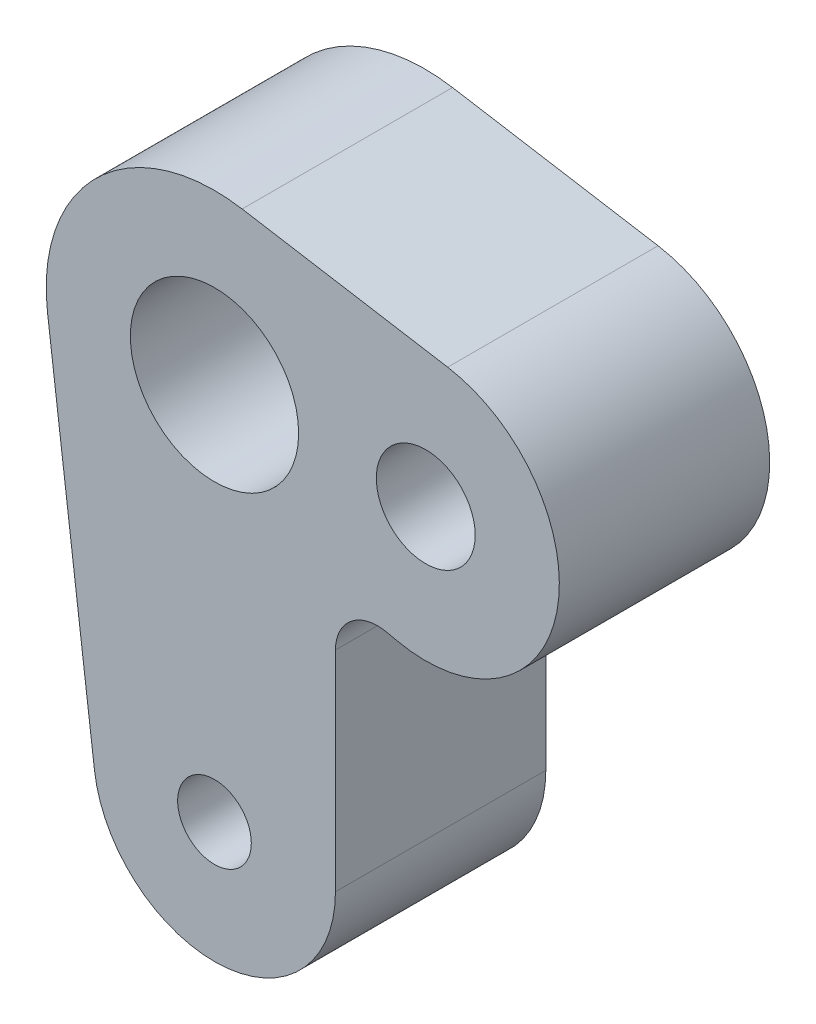
ISO-10303-21;
HEADER;
FILE_DESCRIPTION(('STEP AP214'),'2;1');
FILE_NAME('part.step','',(''),(''),'','','');
FILE_SCHEMA(('AUTOMOTIVE_DESIGN { 1 0 10303 214 1 1 1 1 }'));
ENDSEC;
DATA;
#1=APPLICATION_CONTEXT('core data for automotive mechanical design processes');
#2=APPLICATION_PROTOCOL_DEFINITION('international standard','automotive_design',2000,#1);
#3=PRODUCT_CONTEXT('',#1,'mechanical');
#4=PRODUCT('Part','Part','',(#3));
#5=PRODUCT_RELATED_PRODUCT_CATEGORY('part','',(#4));
#6=PRODUCT_DEFINITION_FORMATION('','',#4);
#7=PRODUCT_DEFINITION_CONTEXT('part definition',#1,'design');
#8=PRODUCT_DEFINITION('design','',#6,#7);
#9=PRODUCT_DEFINITION_SHAPE('','',#8);
#10=(LENGTH_UNIT() NAMED_UNIT(*) SI_UNIT(.MILLI.,.METRE.));
#11=(NAMED_UNIT(*) PLANE_ANGLE_UNIT() SI_UNIT($,.RADIAN.));
#12=(NAMED_UNIT(*) SI_UNIT($,.STERADIAN.) SOLID_ANGLE_UNIT());
#13=UNCERTAINTY_MEASURE_WITH_UNIT(LENGTH_MEASURE(1.E-05),#10,'distance_accuracy_value','');
#14=(GEOMETRIC_REPRESENTATION_CONTEXT(3) GLOBAL_UNCERTAINTY_ASSIGNED_CONTEXT((#13)) GLOBAL_UNIT_ASSIGNED_CONTEXT((#10,
#11,#12)) REPRESENTATION_CONTEXT('',''));
#15=CARTESIAN_POINT('',(0.,0.,0.));
#16=DIRECTION('',(0.,0.,1.));
#17=DIRECTION('',(1.,0.,0.));
#18=AXIS2_PLACEMENT_3D('',#15,#16,#17);
#19=CARTESIAN_POINT('',(10.0423494024106,0.,10.));
#20=DIRECTION('',(0.,0.,-1.));
#21=DIRECTION('',(-1.,0.,0.));
#22=AXIS2_PLACEMENT_3D('',#19,#20,#21);
#23=CYLINDRICAL_SURFACE('',#22,6.35);
#24=CARTESIAN_POINT('',(10.0423494024106,0.,0.));
#25=DIRECTION('',(0.,0.,1.));
#26=DIRECTION('',(1.,0.,0.));
#27=AXIS2_PLACEMENT_3D('',#24,#25,#26);
#28=CIRCLE('',#27,6.35);
#29=CARTESIAN_POINT('',(8.68728342325971,-6.20373244040617,0.));
#30=VERTEX_POINT('',#29);
#31=CARTESIAN_POINT('',(11.0856809556311,6.26370172262812,0.));
#32=VERTEX_POINT('',#31);
#33=EDGE_CURVE('E161',#30,#32,#28,.T.);
#34=ORIENTED_EDGE('',*,*,#33,.T.);
#35=DIRECTION('',(0.,0.,-1.));
#36=VECTOR('',#35,1.);
#37=CARTESIAN_POINT('',(11.0856809556311,6.26370172262812,10.));
#38=LINE('',#37,#36);
#39=CARTESIAN_POINT('',(11.0856809556311,6.26370172262812,10.));
#40=VERTEX_POINT('',#39);
#41=EDGE_CURVE('E11',#40,#32,#38,.T.);
#42=ORIENTED_EDGE('',*,*,#41,.F.);
#43=CARTESIAN_POINT('',(10.0423494024106,0.,10.));
#44=DIRECTION('',(0.,0.,1.));
#45=DIRECTION('',(1.,0.,0.));
#46=AXIS2_PLACEMENT_3D('',#43,#44,#45);
#47=CIRCLE('',#46,6.35);
#48=CARTESIAN_POINT('',(8.68728342325971,-6.20373244040617,10.));
#49=VERTEX_POINT('',#48);
#50=EDGE_CURVE('E195',#49,#40,#47,.T.);
#51=ORIENTED_EDGE('',*,*,#50,.F.);
#52=DIRECTION('',(0.,0.,-1.));
#53=VECTOR('',#52,1.);
#54=CARTESIAN_POINT('',(8.68728342325971,-6.20373244040617,10.));
#55=LINE('',#54,#53);
#56=EDGE_CURVE('E160',#49,#30,#55,.T.);
#57=ORIENTED_EDGE('',*,*,#56,.T.);
#58=EDGE_LOOP('',(#34,#42,#51,#57));
#59=FACE_BOUND('',#58,.T.);
#60=ADVANCED_FACE('F47',(#59),#23,.T.);
#61=CARTESIAN_POINT('',(1.31443345287622,7.89127776079133,10.));
#62=DIRECTION('',(-0.164304181609528,-0.986409720098917,0.));
#63=DIRECTION('',(0.986409720098917,-0.164304181609528,0.));
#64=AXIS2_PLACEMENT_3D('',#61,#62,#63);
#65=PLANE('',#64);
#66=DIRECTION('',(-0.986409720098917,0.164304181609528,0.));
#67=VECTOR('',#66,1.);
#68=CARTESIAN_POINT('',(1.31443345287622,7.89127776079133,0.));
#69=LINE('',#68,#67);
#70=CARTESIAN_POINT('',(1.31443345287622,7.89127776079133,0.));
#71=VERTEX_POINT('',#70);
#72=EDGE_CURVE('E165',#32,#71,#69,.T.);
#73=ORIENTED_EDGE('',*,*,#72,.T.);
#74=DIRECTION('',(0.,0.,-1.));
#75=VECTOR('',#74,1.);
#76=CARTESIAN_POINT('',(1.31443345287622,7.89127776079133,10.));
#77=LINE('',#76,#75);
#78=CARTESIAN_POINT('',(1.31443345287622,7.89127776079133,10.));
#79=VERTEX_POINT('',#78);
#80=EDGE_CURVE('E56',#79,#71,#77,.T.);
#81=ORIENTED_EDGE('',*,*,#80,.F.);
#82=DIRECTION('',(-0.986409720098917,0.164304181609528,0.));
#83=VECTOR('',#82,1.);
#84=CARTESIAN_POINT('',(1.31443345287622,7.89127776079133,10.));
#85=LINE('',#84,#83);
#86=EDGE_CURVE('E107',#40,#79,#85,.T.);
#87=ORIENTED_EDGE('',*,*,#86,.F.);
#88=ORIENTED_EDGE('',*,*,#41,.T.);
#89=EDGE_LOOP('',(#73,#81,#87,#88));
#90=FACE_BOUND('',#89,.T.);
#91=ADVANCED_FACE('F242',(#90),#65,.F.);
#92=CARTESIAN_POINT('',(0.,0.,10.));
#93=DIRECTION('',(0.,0.,-1.));
#94=DIRECTION('',(-1.,0.,0.));
#95=AXIS2_PLACEMENT_3D('',#92,#93,#94);
#96=CYLINDRICAL_SURFACE('',#95,8.);
#97=CARTESIAN_POINT('',(0.,0.,0.));
#98=DIRECTION('',(0.,0.,1.));
#99=DIRECTION('',(1.,0.,0.));
#100=AXIS2_PLACEMENT_3D('',#97,#98,#99);
#101=CIRCLE('',#100,8.);
#102=CARTESIAN_POINT('',(-7.93725393319377,-1.,0.));
#103=VERTEX_POINT('',#102);
#104=EDGE_CURVE('E168',#71,#103,#101,.T.);
#105=ORIENTED_EDGE('',*,*,#104,.T.);
#106=DIRECTION('',(0.,0.,-1.));
#107=VECTOR('',#106,1.);
#108=CARTESIAN_POINT('',(-7.93725393319377,-1.,10.));
#109=LINE('',#108,#107);
#110=CARTESIAN_POINT('',(-7.93725393319377,-1.,10.));
#111=VERTEX_POINT('',#110);
#112=EDGE_CURVE('E206',#111,#103,#109,.T.);
#113=ORIENTED_EDGE('',*,*,#112,.F.);
#114=CARTESIAN_POINT('',(0.,0.,10.));
#115=DIRECTION('',(0.,0.,1.));
#116=DIRECTION('',(1.,0.,0.));
#117=AXIS2_PLACEMENT_3D('',#114,#115,#116);
#118=CIRCLE('',#117,8.);
#119=EDGE_CURVE('E216',#79,#111,#118,.T.);
#120=ORIENTED_EDGE('',*,*,#119,.F.);
#121=ORIENTED_EDGE('',*,*,#80,.T.);
#122=EDGE_LOOP('',(#105,#113,#120,#121));
#123=FACE_BOUND('',#122,.T.);
#124=ADVANCED_FACE('F214',(#123),#96,.T.);
#125=CARTESIAN_POINT('',(-7.93725393319377,-1.,10.));
#126=DIRECTION('',(0.992156741649222,0.125,0.));
#127=DIRECTION('',(-0.125,0.992156741649222,0.));
#128=AXIS2_PLACEMENT_3D('',#125,#126,#127);
#129=PLANE('',#128);
#130=DIRECTION('',(0.125,-0.992156741649222,0.));
#131=VECTOR('',#130,1.);
#132=CARTESIAN_POINT('',(-7.93725393319377,-1.,0.));
#133=LINE('',#132,#131);
#134=CARTESIAN_POINT('',(-5.70490126448302,-18.71875,0.));
#135=VERTEX_POINT('',#134);
#136=EDGE_CURVE('E171',#103,#135,#133,.T.);
#137=ORIENTED_EDGE('',*,*,#136,.T.);
#138=DIRECTION('',(0.,0.,-1.));
#139=VECTOR('',#138,1.);
#140=CARTESIAN_POINT('',(-5.70490126448302,-18.71875,10.));
#141=LINE('',#140,#139);
#142=CARTESIAN_POINT('',(-5.70490126448302,-18.71875,10.));
#143=VERTEX_POINT('',#142);
#144=EDGE_CURVE('E202',#143,#135,#141,.T.);
#145=ORIENTED_EDGE('',*,*,#144,.F.);
#146=DIRECTION('',(0.125,-0.992156741649222,0.));
#147=VECTOR('',#146,1.);
#148=CARTESIAN_POINT('',(-7.93725393319377,-1.,10.));
#149=LINE('',#148,#147);
#150=EDGE_CURVE('E230',#111,#143,#149,.T.);
#151=ORIENTED_EDGE('',*,*,#150,.F.);
#152=ORIENTED_EDGE('',*,*,#112,.T.);
#153=EDGE_LOOP('',(#137,#145,#151,#152));
#154=FACE_BOUND('',#153,.T.);
#155=ADVANCED_FACE('F225',(#154),#129,.F.);
#156=CARTESIAN_POINT('',(0.,-18.,10.));
#157=DIRECTION('',(0.,0.,-1.));
#158=DIRECTION('',(-1.,0.,0.));
#159=AXIS2_PLACEMENT_3D('',#156,#157,#158);
#160=CYLINDRICAL_SURFACE('',#159,5.75);
#161=CARTESIAN_POINT('',(0.,-18.,0.));
#162=DIRECTION('',(0.,0.,1.));
#163=DIRECTION('',(1.,0.,0.));
#164=AXIS2_PLACEMENT_3D('',#161,#162,#163);
#165=CIRCLE('',#164,5.75);
#166=CARTESIAN_POINT('',(5.75,-18.,0.));
#167=VERTEX_POINT('',#166);
#168=EDGE_CURVE('E174',#135,#167,#165,.T.);
#169=ORIENTED_EDGE('',*,*,#168,.T.);
#170=DIRECTION('',(0.,0.,-1.));
#171=VECTOR('',#170,1.);
#172=CARTESIAN_POINT('',(5.75,-18.,10.));
#173=LINE('',#172,#171);
#174=CARTESIAN_POINT('',(5.75,-18.,10.));
#175=VERTEX_POINT('',#174);
#176=EDGE_CURVE('E138',#175,#167,#173,.T.);
#177=ORIENTED_EDGE('',*,*,#176,.F.);
#178=CARTESIAN_POINT('',(0.,-18.,10.));
#179=DIRECTION('',(0.,0.,1.));
#180=DIRECTION('',(1.,0.,0.));
#181=AXIS2_PLACEMENT_3D('',#178,#179,#180);
#182=CIRCLE('',#181,5.75);
#183=EDGE_CURVE('E127',#143,#175,#182,.T.);
#184=ORIENTED_EDGE('',*,*,#183,.F.);
#185=ORIENTED_EDGE('',*,*,#144,.T.);
#186=EDGE_LOOP('',(#169,#177,#184,#185));
#187=FACE_BOUND('',#186,.T.);
#188=ADVANCED_FACE('F228',(#187),#160,.T.);
#189=CARTESIAN_POINT('',(5.75,0.,10.));
#190=DIRECTION('',(-1.,0.,0.));
#191=DIRECTION('',(0.,-1.,0.));
#192=AXIS2_PLACEMENT_3D('',#189,#190,#191);
#193=PLANE('',#192);
#194=DIRECTION('',(0.,1.,0.));
#195=VECTOR('',#194,1.);
#196=CARTESIAN_POINT('',(5.75,0.,0.));
#197=LINE('',#196,#195);
#198=CARTESIAN_POINT('',(5.75,-8.04615862981971,0.));
#199=VERTEX_POINT('',#198);
#200=EDGE_CURVE('E136',#167,#199,#197,.T.);
#201=ORIENTED_EDGE('',*,*,#200,.T.);
#202=DIRECTION('',(0.,0.,-1.));
#203=VECTOR('',#202,1.);
#204=CARTESIAN_POINT('',(5.75,-8.04615862981971,10.));
#205=LINE('',#204,#203);
#206=CARTESIAN_POINT('',(5.75,-8.04615862981971,10.));
#207=VERTEX_POINT('',#206);
#208=EDGE_CURVE('E133',#207,#199,#205,.T.);
#209=ORIENTED_EDGE('',*,*,#208,.F.);
#210=DIRECTION('',(0.,1.,0.));
#211=VECTOR('',#210,1.);
#212=CARTESIAN_POINT('',(5.75,0.,10.));
#213=LINE('',#212,#211);
#214=EDGE_CURVE('E120',#175,#207,#213,.T.);
#215=ORIENTED_EDGE('',*,*,#214,.F.);
#216=ORIENTED_EDGE('',*,*,#176,.T.);
#217=EDGE_LOOP('',(#201,#209,#215,#216));
#218=FACE_BOUND('',#217,.T.);
#219=ADVANCED_FACE('F134',(#218),#193,.F.);
#220=CARTESIAN_POINT('',(7.75,-8.04615862981971,10.));
#221=DIRECTION('',(0.,0.,-1.));
#222=DIRECTION('',(-1.,0.,0.));
#223=AXIS2_PLACEMENT_3D('',#220,#221,#222);
#224=CYLINDRICAL_SURFACE('',#223,2.);
#225=CARTESIAN_POINT('',(7.75,-8.04615862981971,0.));
#226=DIRECTION('',(0.,0.,1.));
#227=DIRECTION('',(1.,0.,0.));
#228=AXIS2_PLACEMENT_3D('',#225,#226,#227);
#229=CIRCLE('',#228,2.);
#230=CARTESIAN_POINT('',(8.17679243437823,-6.09222715252643,0.));
#231=VERTEX_POINT('',#230);
#232=EDGE_CURVE('E93',#199,#231,#229,.F.);
#233=ORIENTED_EDGE('',*,*,#232,.T.);
#234=DIRECTION('',(0.,0.,-1.));
#235=VECTOR('',#234,1.);
#236=CARTESIAN_POINT('',(8.17679243437823,-6.09222715252643,10.));
#237=LINE('',#236,#235);
#238=CARTESIAN_POINT('',(8.17679243437823,-6.09222715252643,10.));
#239=VERTEX_POINT('',#238);
#240=EDGE_CURVE('E139',#239,#231,#237,.T.);
#241=ORIENTED_EDGE('',*,*,#240,.F.);
#242=CARTESIAN_POINT('',(7.75,-8.04615862981971,10.));
#243=DIRECTION('',(0.,0.,1.));
#244=DIRECTION('',(1.,0.,0.));
#245=AXIS2_PLACEMENT_3D('',#242,#243,#244);
#246=CIRCLE('',#245,2.);
#247=EDGE_CURVE('E125',#207,#239,#246,.F.);
#248=ORIENTED_EDGE('',*,*,#247,.F.);
#249=ORIENTED_EDGE('',*,*,#208,.T.);
#250=EDGE_LOOP('',(#233,#241,#248,#249));
#251=FACE_BOUND('',#250,.T.);
#252=ADVANCED_FACE('F141',(#251),#224,.F.);
#253=CARTESIAN_POINT('',(0.,0.,10.));
#254=DIRECTION('',(0.,0.,-1.));
#255=DIRECTION('',(-1.,0.,0.));
#256=AXIS2_PLACEMENT_3D('',#253,#254,#255);
#257=CYLINDRICAL_SURFACE('',#256,4.);
#258=CARTESIAN_POINT('',(0.,0.,10.));
#259=DIRECTION('',(0.,0.,1.));
#260=DIRECTION('',(1.,0.,0.));
#261=AXIS2_PLACEMENT_3D('',#258,#259,#260);
#262=CIRCLE('',#261,4.);
#263=CARTESIAN_POINT('',(4.,0.,10.));
#264=VERTEX_POINT('',#263);
#265=EDGE_CURVE('E152',#264,#264,#262,.T.);
#266=ORIENTED_EDGE('',*,*,#265,.T.);
#267=EDGE_LOOP('',(#266));
#268=FACE_BOUND('',#267,.T.);
#269=CARTESIAN_POINT('',(0.,0.,0.));
#270=DIRECTION('',(0.,0.,1.));
#271=DIRECTION('',(1.,0.,0.));
#272=AXIS2_PLACEMENT_3D('',#269,#270,#271);
#273=CIRCLE('',#272,4.);
#274=CARTESIAN_POINT('',(4.,0.,0.));
#275=VERTEX_POINT('',#274);
#276=EDGE_CURVE('E187',#275,#275,#273,.T.);
#277=ORIENTED_EDGE('',*,*,#276,.F.);
#278=EDGE_LOOP('',(#277));
#279=FACE_BOUND('',#278,.T.);
#280=ADVANCED_FACE('F258',(#268,#279),#257,.F.);
#281=CARTESIAN_POINT('',(10.0423494024106,0.,10.));
#282=DIRECTION('',(0.,0.,-1.));
#283=DIRECTION('',(-1.,0.,0.));
#284=AXIS2_PLACEMENT_3D('',#281,#282,#283);
#285=CYLINDRICAL_SURFACE('',#284,2.35);
#286=CARTESIAN_POINT('',(10.0423494024106,0.,10.));
#287=DIRECTION('',(0.,0.,1.));
#288=DIRECTION('',(1.,0.,0.));
#289=AXIS2_PLACEMENT_3D('',#286,#287,#288);
#290=CIRCLE('',#289,2.35);
#291=CARTESIAN_POINT('',(12.3923494024106,0.,10.));
#292=VERTEX_POINT('',#291);
#293=EDGE_CURVE('E145',#292,#292,#290,.T.);
#294=ORIENTED_EDGE('',*,*,#293,.T.);
#295=EDGE_LOOP('',(#294));
#296=FACE_BOUND('',#295,.T.);
#297=CARTESIAN_POINT('',(10.0423494024106,0.,0.));
#298=DIRECTION('',(0.,0.,1.));
#299=DIRECTION('',(1.,0.,0.));
#300=AXIS2_PLACEMENT_3D('',#297,#298,#299);
#301=CIRCLE('',#300,2.35);
#302=CARTESIAN_POINT('',(12.3923494024106,0.,0.));
#303=VERTEX_POINT('',#302);
#304=EDGE_CURVE('E183',#303,#303,#301,.T.);
#305=ORIENTED_EDGE('',*,*,#304,.F.);
#306=EDGE_LOOP('',(#305));
#307=FACE_BOUND('',#306,.T.);
#308=ADVANCED_FACE('F263',(#296,#307),#285,.F.);
#309=CARTESIAN_POINT('',(-0.897758019265263,-4.11009547390499,10.));
#310=DIRECTION('',(0.213396217189116,0.97696573864664,0.));
#311=DIRECTION('',(-0.97696573864664,0.213396217189116,0.));
#312=AXIS2_PLACEMENT_3D('',#309,#310,#311);
#313=PLANE('',#312);
#314=DIRECTION('',(0.97696573864664,-0.213396217189116,0.));
#315=VECTOR('',#314,1.);
#316=CARTESIAN_POINT('',(-0.897758019265263,-4.11009547390499,0.));
#317=LINE('',#316,#315);
#318=EDGE_CURVE('E99',#231,#30,#317,.T.);
#319=ORIENTED_EDGE('',*,*,#318,.T.);
#320=ORIENTED_EDGE('',*,*,#56,.F.);
#321=DIRECTION('',(0.97696573864664,-0.213396217189116,0.));
#322=VECTOR('',#321,1.);
#323=CARTESIAN_POINT('',(-0.897758019265263,-4.11009547390499,10.));
#324=LINE('',#323,#322);
#325=EDGE_CURVE('E64',#239,#49,#324,.T.);
#326=ORIENTED_EDGE('',*,*,#325,.F.);
#327=ORIENTED_EDGE('',*,*,#240,.T.);
#328=EDGE_LOOP('',(#319,#320,#326,#327));
#329=FACE_BOUND('',#328,.T.);
#330=ADVANCED_FACE('F259',(#329),#313,.F.);
#331=CARTESIAN_POINT('',(0.,-18.,10.));
#332=DIRECTION('',(0.,0.,-1.));
#333=DIRECTION('',(-1.,0.,0.));
#334=AXIS2_PLACEMENT_3D('',#331,#332,#333);
#335=CYLINDRICAL_SURFACE('',#334,1.75);
#336=CARTESIAN_POINT('',(0.,-18.,10.));
#337=DIRECTION('',(0.,0.,1.));
#338=DIRECTION('',(1.,0.,0.));
#339=AXIS2_PLACEMENT_3D('',#336,#337,#338);
#340=CIRCLE('',#339,1.75);
#341=CARTESIAN_POINT('',(1.75,-18.,10.));
#342=VERTEX_POINT('',#341);
#343=EDGE_CURVE('E156',#342,#342,#340,.T.);
#344=ORIENTED_EDGE('',*,*,#343,.T.);
#345=EDGE_LOOP('',(#344));
#346=FACE_BOUND('',#345,.T.);
#347=CARTESIAN_POINT('',(0.,-18.,0.));
#348=DIRECTION('',(0.,0.,1.));
#349=DIRECTION('',(1.,0.,0.));
#350=AXIS2_PLACEMENT_3D('',#347,#348,#349);
#351=CIRCLE('',#350,1.75);
#352=CARTESIAN_POINT('',(1.75,-18.,0.));
#353=VERTEX_POINT('',#352);
#354=EDGE_CURVE('E191',#353,#353,#351,.T.);
#355=ORIENTED_EDGE('',*,*,#354,.F.);
#356=EDGE_LOOP('',(#355));
#357=FACE_BOUND('',#356,.T.);
#358=ADVANCED_FACE('F262',(#346,#357),#335,.F.);
#359=CARTESIAN_POINT('',(0.,0.,10.));
#360=DIRECTION('',(0.,0.,1.));
#361=DIRECTION('',(1.,0.,0.));
#362=AXIS2_PLACEMENT_3D('',#359,#360,#361);
#363=PLANE('',#362);
#364=ORIENTED_EDGE('',*,*,#50,.T.);
#365=ORIENTED_EDGE('',*,*,#86,.T.);
#366=ORIENTED_EDGE('',*,*,#119,.T.);
#367=ORIENTED_EDGE('',*,*,#150,.T.);
#368=ORIENTED_EDGE('',*,*,#183,.T.);
#369=ORIENTED_EDGE('',*,*,#214,.T.);
#370=ORIENTED_EDGE('',*,*,#247,.T.);
#371=ORIENTED_EDGE('',*,*,#325,.T.);
#372=EDGE_LOOP('',(#364,#365,#366,#367,#368,#369,#370,#371));
#373=FACE_BOUND('',#372,.T.);
#374=ORIENTED_EDGE('',*,*,#293,.F.);
#375=EDGE_LOOP('',(#374));
#376=FACE_BOUND('',#375,.T.);
#377=ORIENTED_EDGE('',*,*,#265,.F.);
#378=EDGE_LOOP('',(#377));
#379=FACE_BOUND('',#378,.T.);
#380=ORIENTED_EDGE('',*,*,#343,.F.);
#381=EDGE_LOOP('',(#380));
#382=FACE_BOUND('',#381,.T.);
#383=ADVANCED_FACE('F122',(#373,#376,#379,#382),#363,.T.);
#384=CARTESIAN_POINT('',(0.,0.,0.));
#385=DIRECTION('',(0.,0.,1.));
#386=DIRECTION('',(1.,0.,0.));
#387=AXIS2_PLACEMENT_3D('',#384,#385,#386);
#388=PLANE('',#387);
#389=ORIENTED_EDGE('',*,*,#33,.F.);
#390=ORIENTED_EDGE('',*,*,#318,.F.);
#391=ORIENTED_EDGE('',*,*,#232,.F.);
#392=ORIENTED_EDGE('',*,*,#200,.F.);
#393=ORIENTED_EDGE('',*,*,#168,.F.);
#394=ORIENTED_EDGE('',*,*,#136,.F.);
#395=ORIENTED_EDGE('',*,*,#104,.F.);
#396=ORIENTED_EDGE('',*,*,#72,.F.);
#397=EDGE_LOOP('',(#389,#390,#391,#392,#393,#394,#395,#396));
#398=FACE_BOUND('',#397,.T.);
#399=ORIENTED_EDGE('',*,*,#304,.T.);
#400=EDGE_LOOP('',(#399));
#401=FACE_BOUND('',#400,.T.);
#402=ORIENTED_EDGE('',*,*,#276,.T.);
#403=EDGE_LOOP('',(#402));
#404=FACE_BOUND('',#403,.T.);
#405=ORIENTED_EDGE('',*,*,#354,.T.);
#406=EDGE_LOOP('',(#405));
#407=FACE_BOUND('',#406,.T.);
#408=ADVANCED_FACE('F220',(#398,#401,#404,#407),#388,.F.);
#409=CLOSED_SHELL('',(#60,#91,#124,#155,#188,#219,#252,#280,#308,#330,#358,#383,#408));
#410=MANIFOLD_SOLID_BREP('B2',#409);
#411=ADVANCED_BREP_SHAPE_REPRESENTATION('',(#18,#410),#14);
#412=SHAPE_DEFINITION_REPRESENTATION(#9,#411);
ENDSEC;
END-ISO-10303-21;
